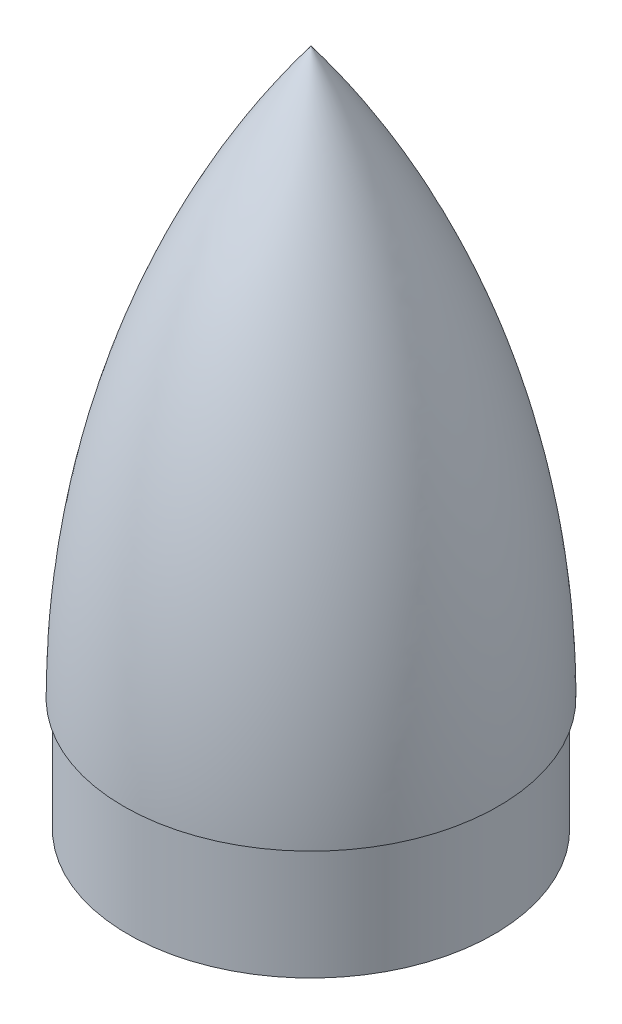
ISO-10303-21;
HEADER;
FILE_DESCRIPTION(('STEP AP214'),'2;1');
FILE_NAME('part.step','',(''),(''),'','','');
FILE_SCHEMA(('AUTOMOTIVE_DESIGN { 1 0 10303 214 1 1 1 1 }'));
ENDSEC;
DATA;
#1=APPLICATION_CONTEXT('core data for automotive mechanical design processes');
#2=APPLICATION_PROTOCOL_DEFINITION('international standard','automotive_design',2000,#1);
#3=PRODUCT_CONTEXT('',#1,'mechanical');
#4=PRODUCT('Part','Part','',(#3));
#5=PRODUCT_RELATED_PRODUCT_CATEGORY('part','',(#4));
#6=PRODUCT_DEFINITION_FORMATION('','',#4);
#7=PRODUCT_DEFINITION_CONTEXT('part definition',#1,'design');
#8=PRODUCT_DEFINITION('design','',#6,#7);
#9=PRODUCT_DEFINITION_SHAPE('','',#8);
#10=(LENGTH_UNIT() NAMED_UNIT(*) SI_UNIT(.MILLI.,.METRE.));
#11=(NAMED_UNIT(*) PLANE_ANGLE_UNIT() SI_UNIT($,.RADIAN.));
#12=(NAMED_UNIT(*) SI_UNIT($,.STERADIAN.) SOLID_ANGLE_UNIT());
#13=UNCERTAINTY_MEASURE_WITH_UNIT(LENGTH_MEASURE(1.E-05),#10,'distance_accuracy_value','');
#14=(GEOMETRIC_REPRESENTATION_CONTEXT(3) GLOBAL_UNCERTAINTY_ASSIGNED_CONTEXT((#13)) GLOBAL_UNIT_ASSIGNED_CONTEXT((#10,
#11,#12)) REPRESENTATION_CONTEXT('',''));
#15=CARTESIAN_POINT('',(0.,0.,0.));
#16=DIRECTION('',(0.,0.,1.));
#17=DIRECTION('',(1.,0.,0.));
#18=AXIS2_PLACEMENT_3D('',#15,#16,#17);
#19=CARTESIAN_POINT('',(0.,0.,134.204077201447));
#20=DIRECTION('',(-1.,0.,0.));
#21=DIRECTION('',(0.,0.,-1.));
#22=AXIS2_PLACEMENT_3D('',#19,#20,#21);
#23=CIRCLE('',#22,167.364077201447);
#24=TRIMMED_CURVE('',#23,(PARAMETER_VALUE(-0.64037948808409)),
(PARAMETER_VALUE(0.64037948808409)),.T.,.PARAMETER.);
#25=CARTESIAN_POINT('',(0.,0.,0.));
#26=DIRECTION('',(0.,-1.,0.));
#27=AXIS1_PLACEMENT('',#25,#26);
#28=SURFACE_OF_REVOLUTION('',#24,#27);
#29=CARTESIAN_POINT('',(0.,100.,0.));
#30=VERTEX_POINT('',#29);
#31=VERTEX_LOOP('',#30);
#32=FACE_BOUND('',#31,.T.);
#33=CARTESIAN_POINT('',(0.,0.,0.));
#34=DIRECTION('',(0.,-1.,0.));
#35=DIRECTION('',(0.,0.,-1.));
#36=AXIS2_PLACEMENT_3D('',#33,#34,#35);
#37=CIRCLE('',#36,33.16);
#38=CARTESIAN_POINT('',(0.,0.,-33.16));
#39=VERTEX_POINT('',#38);
#40=EDGE_CURVE('E11',#39,#39,#37,.T.);
#41=ORIENTED_EDGE('',*,*,#40,.F.);
#42=EDGE_LOOP('',(#41));
#43=FACE_BOUND('',#42,.T.);
#44=ADVANCED_FACE('F32',(#32,#43),#28,.T.);
#45=CARTESIAN_POINT('',(32.385,0.,0.));
#46=DIRECTION('',(0.,-1.,0.));
#47=DIRECTION('',(0.,0.,-1.));
#48=AXIS2_PLACEMENT_3D('',#45,#46,#47);
#49=PLANE('',#48);
#50=ORIENTED_EDGE('',*,*,#40,.T.);
#51=EDGE_LOOP('',(#50));
#52=FACE_BOUND('',#51,.T.);
#53=CARTESIAN_POINT('',(0.,0.,0.));
#54=DIRECTION('',(0.,-1.,0.));
#55=DIRECTION('',(0.,0.,-1.));
#56=AXIS2_PLACEMENT_3D('',#53,#54,#55);
#57=CIRCLE('',#56,32.385);
#58=CARTESIAN_POINT('',(0.,0.,-32.385));
#59=VERTEX_POINT('',#58);
#60=EDGE_CURVE('E39',#59,#59,#57,.T.);
#61=ORIENTED_EDGE('',*,*,#60,.F.);
#62=EDGE_LOOP('',(#61));
#63=FACE_BOUND('',#62,.T.);
#64=ADVANCED_FACE('F47',(#52,#63),#49,.T.);
#65=CARTESIAN_POINT('',(0.,85.,0.));
#66=DIRECTION('',(0.,-1.,0.));
#67=DIRECTION('',(0.,0.,-1.));
#68=AXIS2_PLACEMENT_3D('',#65,#66,#67);
#69=CYLINDRICAL_SURFACE('',#68,32.385);
#70=ORIENTED_EDGE('',*,*,#60,.T.);
#71=EDGE_LOOP('',(#70));
#72=FACE_BOUND('',#71,.T.);
#73=CARTESIAN_POINT('',(0.,-20.,0.));
#74=DIRECTION('',(0.,-1.,0.));
#75=DIRECTION('',(0.,0.,-1.));
#76=AXIS2_PLACEMENT_3D('',#73,#74,#75);
#77=CIRCLE('',#76,32.385);
#78=CARTESIAN_POINT('',(0.,-20.,-32.385));
#79=VERTEX_POINT('',#78);
#80=EDGE_CURVE('E56',#79,#79,#77,.T.);
#81=ORIENTED_EDGE('',*,*,#80,.F.);
#82=EDGE_LOOP('',(#81));
#83=FACE_BOUND('',#82,.T.);
#84=ADVANCED_FACE('F52',(#72,#83),#69,.T.);
#85=CARTESIAN_POINT('',(32.385,-20.,0.));
#86=DIRECTION('',(0.,-1.,0.));
#87=DIRECTION('',(0.,0.,-1.));
#88=AXIS2_PLACEMENT_3D('',#85,#86,#87);
#89=PLANE('',#88);
#90=ORIENTED_EDGE('',*,*,#80,.T.);
#91=EDGE_LOOP('',(#90));
#92=FACE_BOUND('',#91,.T.);
#93=CARTESIAN_POINT('',(0.,-20.,0.));
#94=DIRECTION('',(0.,-1.,0.));
#95=DIRECTION('',(0.,0.,-1.));
#96=AXIS2_PLACEMENT_3D('',#93,#94,#95);
#97=CIRCLE('',#96,27.385);
#98=CARTESIAN_POINT('',(0.,-20.,-27.385));
#99=VERTEX_POINT('',#98);
#100=EDGE_CURVE('E58',#99,#99,#97,.T.);
#101=ORIENTED_EDGE('',*,*,#100,.F.);
#102=EDGE_LOOP('',(#101));
#103=FACE_BOUND('',#102,.T.);
#104=ADVANCED_FACE('F71',(#92,#103),#89,.T.);
#105=CARTESIAN_POINT('',(0.,85.,0.));
#106=DIRECTION('',(0.,-1.,0.));
#107=DIRECTION('',(0.,0.,-1.));
#108=AXIS2_PLACEMENT_3D('',#105,#106,#107);
#109=CYLINDRICAL_SURFACE('',#108,27.385);
#110=ORIENTED_EDGE('',*,*,#100,.T.);
#111=EDGE_LOOP('',(#110));
#112=FACE_BOUND('',#111,.T.);
#113=CARTESIAN_POINT('',(0.,7.82982546994189,0.));
#114=DIRECTION('',(0.,-1.,0.));
#115=DIRECTION('',(0.,0.,-1.));
#116=AXIS2_PLACEMENT_3D('',#113,#114,#115);
#117=CIRCLE('',#116,27.385);
#118=CARTESIAN_POINT('',(0.,7.82982546994189,-27.385));
#119=VERTEX_POINT('',#118);
#120=EDGE_CURVE('E63',#119,#119,#117,.T.);
#121=ORIENTED_EDGE('',*,*,#120,.F.);
#122=EDGE_LOOP('',(#121));
#123=FACE_BOUND('',#122,.T.);
#124=ADVANCED_FACE('F69',(#112,#123),#109,.F.);
#125=CARTESIAN_POINT('',(0.,7.82982546994189,95.0392114661243));
#126=DIRECTION('',(-1.,0.,0.));
#127=DIRECTION('',(0.,0.,-1.));
#128=AXIS2_PLACEMENT_3D('',#125,#126,#127);
#129=CIRCLE('',#128,122.424211466124);
#130=TRIMMED_CURVE('',#129,(PARAMETER_VALUE(-0.682004745623138)),
(PARAMETER_VALUE(0.682004745623138)),.T.,.PARAMETER.);
#131=CARTESIAN_POINT('',(0.,7.82982546994189,0.));
#132=DIRECTION('',(0.,-1.,0.));
#133=AXIS1_PLACEMENT('',#131,#132);
#134=SURFACE_OF_REVOLUTION('',#130,#133);
#135=ORIENTED_EDGE('',*,*,#120,.T.);
#136=EDGE_LOOP('',(#135));
#137=FACE_BOUND('',#136,.T.);
#138=CARTESIAN_POINT('',(0.,85.,0.));
#139=VERTEX_POINT('',#138);
#140=VERTEX_LOOP('',#139);
#141=FACE_BOUND('',#140,.T.);
#142=ADVANCED_FACE('F67',(#137,#141),#134,.F.);
#143=CLOSED_SHELL('',(#44,#64,#84,#104,#124,#142));
#144=MANIFOLD_SOLID_BREP('B2',#143);
#145=ADVANCED_BREP_SHAPE_REPRESENTATION('',(#18,#144),#14);
#146=SHAPE_DEFINITION_REPRESENTATION(#9,#145);
ENDSEC;
END-ISO-10303-21;
